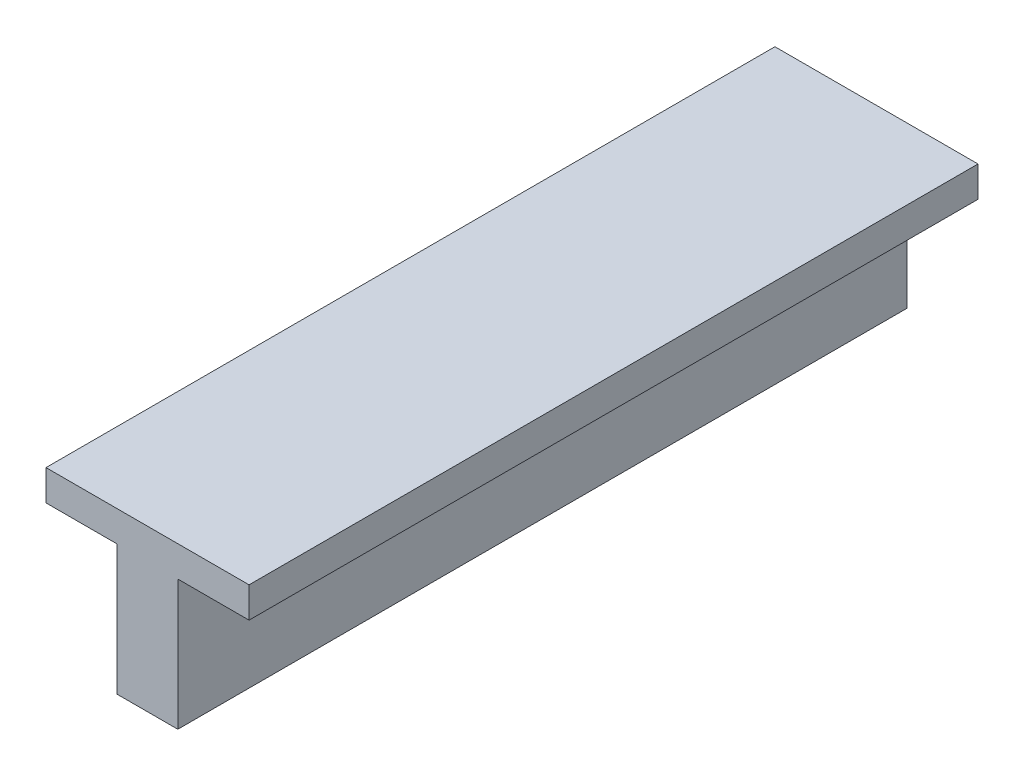
ISO-10303-21;
HEADER;
FILE_DESCRIPTION(('STEP AP214'),'2;1');
FILE_NAME('part.step','',(''),(''),'','','');
FILE_SCHEMA(('AUTOMOTIVE_DESIGN { 1 0 10303 214 1 1 1 1 }'));
ENDSEC;
DATA;
#1=APPLICATION_CONTEXT('core data for automotive mechanical design processes');
#2=APPLICATION_PROTOCOL_DEFINITION('international standard','automotive_design',2000,#1);
#3=PRODUCT_CONTEXT('',#1,'mechanical');
#4=PRODUCT('Part','Part','',(#3));
#5=PRODUCT_RELATED_PRODUCT_CATEGORY('part','',(#4));
#6=PRODUCT_DEFINITION_FORMATION('','',#4);
#7=PRODUCT_DEFINITION_CONTEXT('part definition',#1,'design');
#8=PRODUCT_DEFINITION('design','',#6,#7);
#9=PRODUCT_DEFINITION_SHAPE('','',#8);
#10=(LENGTH_UNIT() NAMED_UNIT(*) SI_UNIT(.MILLI.,.METRE.));
#11=(NAMED_UNIT(*) PLANE_ANGLE_UNIT() SI_UNIT($,.RADIAN.));
#12=(NAMED_UNIT(*) SI_UNIT($,.STERADIAN.) SOLID_ANGLE_UNIT());
#13=UNCERTAINTY_MEASURE_WITH_UNIT(LENGTH_MEASURE(1.E-05),#10,'distance_accuracy_value','');
#14=(GEOMETRIC_REPRESENTATION_CONTEXT(3) GLOBAL_UNCERTAINTY_ASSIGNED_CONTEXT((#13)) GLOBAL_UNIT_ASSIGNED_CONTEXT((#10,
#11,#12)) REPRESENTATION_CONTEXT('',''));
#15=CARTESIAN_POINT('',(0.,0.,0.));
#16=DIRECTION('',(0.,0.,1.));
#17=DIRECTION('',(1.,0.,0.));
#18=AXIS2_PLACEMENT_3D('',#15,#16,#17);
#19=CARTESIAN_POINT('',(-1.273023173553,-0.385219535327772,0.));
#20=DIRECTION('',(0.,-1.,0.));
#21=DIRECTION('',(1.,0.,0.));
#22=AXIS2_PLACEMENT_3D('',#19,#20,#21);
#23=PLANE('',#22);
#24=DIRECTION('',(-1.,0.,0.));
#25=VECTOR('',#24,1.);
#26=CARTESIAN_POINT('',(-1.2632489838099,-0.385219535327772,0.));
#27=LINE('',#26,#25);
#28=CARTESIAN_POINT('',(-1.2632489838099,-0.385219535327772,0.));
#29=VERTEX_POINT('',#28);
#30=CARTESIAN_POINT('',(-1.273023173553,-0.385219535327772,0.));
#31=VERTEX_POINT('',#30);
#32=EDGE_CURVE('E11',#29,#31,#27,.T.);
#33=ORIENTED_EDGE('',*,*,#32,.F.);
#34=DIRECTION('',(0.,0.,1.));
#35=VECTOR('',#34,1.);
#36=CARTESIAN_POINT('',(-1.2632489838099,-0.385219535327772,0.));
#37=LINE('',#36,#35);
#38=CARTESIAN_POINT('',(-1.2632489838099,-0.385219535327772,0.1));
#39=VERTEX_POINT('',#38);
#40=EDGE_CURVE('E24',#29,#39,#37,.T.);
#41=ORIENTED_EDGE('',*,*,#40,.T.);
#42=DIRECTION('',(1.,0.,0.));
#43=VECTOR('',#42,1.);
#44=CARTESIAN_POINT('',(-1.2632489838099,-0.385219535327772,0.1));
#45=LINE('',#44,#43);
#46=CARTESIAN_POINT('',(-1.273023173553,-0.385219535327772,0.1));
#47=VERTEX_POINT('',#46);
#48=EDGE_CURVE('E100',#47,#39,#45,.T.);
#49=ORIENTED_EDGE('',*,*,#48,.F.);
#50=DIRECTION('',(0.,0.,1.));
#51=VECTOR('',#50,1.);
#52=CARTESIAN_POINT('',(-1.273023173553,-0.385219535327772,0.));
#53=LINE('',#52,#51);
#54=EDGE_CURVE('E141',#31,#47,#53,.T.);
#55=ORIENTED_EDGE('',*,*,#54,.F.);
#56=EDGE_LOOP('',(#33,#41,#49,#55));
#57=FACE_BOUND('',#56,.T.);
#58=ADVANCED_FACE('F17',(#57),#23,.T.);
#59=CARTESIAN_POINT('',(-1.273023173553,-0.381020386169379,0.));
#60=DIRECTION('',(-1.,0.,0.));
#61=DIRECTION('',(0.,-1.,0.));
#62=AXIS2_PLACEMENT_3D('',#59,#60,#61);
#63=PLANE('',#62);
#64=DIRECTION('',(0.,1.,0.));
#65=VECTOR('',#64,1.);
#66=CARTESIAN_POINT('',(-1.273023173553,-0.385219535327772,0.));
#67=LINE('',#66,#65);
#68=CARTESIAN_POINT('',(-1.273023173553,-0.381020386169379,0.));
#69=VERTEX_POINT('',#68);
#70=EDGE_CURVE('E139',#31,#69,#67,.T.);
#71=ORIENTED_EDGE('',*,*,#70,.F.);
#72=ORIENTED_EDGE('',*,*,#54,.T.);
#73=DIRECTION('',(0.,-1.,0.));
#74=VECTOR('',#73,1.);
#75=CARTESIAN_POINT('',(-1.273023173553,-0.385219535327772,0.1));
#76=LINE('',#75,#74);
#77=CARTESIAN_POINT('',(-1.273023173553,-0.381020386169379,0.1));
#78=VERTEX_POINT('',#77);
#79=EDGE_CURVE('E137',#78,#47,#76,.T.);
#80=ORIENTED_EDGE('',*,*,#79,.F.);
#81=DIRECTION('',(0.,0.,1.));
#82=VECTOR('',#81,1.);
#83=CARTESIAN_POINT('',(-1.273023173553,-0.381020386169379,0.));
#84=LINE('',#83,#82);
#85=EDGE_CURVE('E134',#69,#78,#84,.T.);
#86=ORIENTED_EDGE('',*,*,#85,.F.);
#87=EDGE_LOOP('',(#71,#72,#80,#86));
#88=FACE_BOUND('',#87,.T.);
#89=ADVANCED_FACE('F163',(#88),#63,.T.);
#90=CARTESIAN_POINT('',(-1.245165839349,-0.381020386169379,0.));
#91=DIRECTION('',(0.,1.,0.));
#92=DIRECTION('',(-1.,0.,0.));
#93=AXIS2_PLACEMENT_3D('',#90,#91,#92);
#94=PLANE('',#93);
#95=DIRECTION('',(1.,0.,0.));
#96=VECTOR('',#95,1.);
#97=CARTESIAN_POINT('',(-1.273023173553,-0.381020386169379,0.));
#98=LINE('',#97,#96);
#99=CARTESIAN_POINT('',(-1.245165839349,-0.381020386169379,0.));
#100=VERTEX_POINT('',#99);
#101=EDGE_CURVE('E132',#69,#100,#98,.T.);
#102=ORIENTED_EDGE('',*,*,#101,.F.);
#103=ORIENTED_EDGE('',*,*,#85,.T.);
#104=DIRECTION('',(-1.,0.,0.));
#105=VECTOR('',#104,1.);
#106=CARTESIAN_POINT('',(-1.273023173553,-0.381020386169379,0.1));
#107=LINE('',#106,#105);
#108=CARTESIAN_POINT('',(-1.245165839349,-0.381020386169379,0.1));
#109=VERTEX_POINT('',#108);
#110=EDGE_CURVE('E129',#109,#78,#107,.T.);
#111=ORIENTED_EDGE('',*,*,#110,.F.);
#112=DIRECTION('',(0.,0.,1.));
#113=VECTOR('',#112,1.);
#114=CARTESIAN_POINT('',(-1.245165839349,-0.381020386169379,0.));
#115=LINE('',#114,#113);
#116=EDGE_CURVE('E126',#100,#109,#115,.T.);
#117=ORIENTED_EDGE('',*,*,#116,.F.);
#118=EDGE_LOOP('',(#102,#103,#111,#117));
#119=FACE_BOUND('',#118,.T.);
#120=ADVANCED_FACE('F159',(#119),#94,.T.);
#121=CARTESIAN_POINT('',(-1.245165839349,-0.385219535327772,0.));
#122=DIRECTION('',(1.,0.,0.));
#123=DIRECTION('',(0.,1.,0.));
#124=AXIS2_PLACEMENT_3D('',#121,#122,#123);
#125=PLANE('',#124);
#126=DIRECTION('',(0.,-1.,0.));
#127=VECTOR('',#126,1.);
#128=CARTESIAN_POINT('',(-1.245165839349,-0.381020386169379,0.));
#129=LINE('',#128,#127);
#130=CARTESIAN_POINT('',(-1.245165839349,-0.385219535327772,0.));
#131=VERTEX_POINT('',#130);
#132=EDGE_CURVE('E124',#100,#131,#129,.T.);
#133=ORIENTED_EDGE('',*,*,#132,.F.);
#134=ORIENTED_EDGE('',*,*,#116,.T.);
#135=DIRECTION('',(0.,1.,0.));
#136=VECTOR('',#135,1.);
#137=CARTESIAN_POINT('',(-1.245165839349,-0.381020386169379,0.1));
#138=LINE('',#137,#136);
#139=CARTESIAN_POINT('',(-1.245165839349,-0.385219535327772,0.1));
#140=VERTEX_POINT('',#139);
#141=EDGE_CURVE('E121',#140,#109,#138,.T.);
#142=ORIENTED_EDGE('',*,*,#141,.F.);
#143=DIRECTION('',(0.,0.,1.));
#144=VECTOR('',#143,1.);
#145=CARTESIAN_POINT('',(-1.245165839349,-0.385219535327772,0.));
#146=LINE('',#145,#144);
#147=EDGE_CURVE('E118',#131,#140,#146,.T.);
#148=ORIENTED_EDGE('',*,*,#147,.F.);
#149=EDGE_LOOP('',(#133,#134,#142,#148));
#150=FACE_BOUND('',#149,.T.);
#151=ADVANCED_FACE('F155',(#150),#125,.T.);
#152=CARTESIAN_POINT('',(-1.2549400290922,-0.385219535327772,0.));
#153=DIRECTION('',(0.,-1.,0.));
#154=DIRECTION('',(1.,0.,0.));
#155=AXIS2_PLACEMENT_3D('',#152,#153,#154);
#156=PLANE('',#155);
#157=DIRECTION('',(-1.,0.,0.));
#158=VECTOR('',#157,1.);
#159=CARTESIAN_POINT('',(-1.245165839349,-0.385219535327772,0.));
#160=LINE('',#159,#158);
#161=CARTESIAN_POINT('',(-1.2549400290922,-0.385219535327772,0.));
#162=VERTEX_POINT('',#161);
#163=EDGE_CURVE('E116',#131,#162,#160,.T.);
#164=ORIENTED_EDGE('',*,*,#163,.F.);
#165=ORIENTED_EDGE('',*,*,#147,.T.);
#166=DIRECTION('',(1.,0.,0.));
#167=VECTOR('',#166,1.);
#168=CARTESIAN_POINT('',(-1.245165839349,-0.385219535327772,0.1));
#169=LINE('',#168,#167);
#170=CARTESIAN_POINT('',(-1.2549400290922,-0.385219535327772,0.1));
#171=VERTEX_POINT('',#170);
#172=EDGE_CURVE('E113',#171,#140,#169,.T.);
#173=ORIENTED_EDGE('',*,*,#172,.F.);
#174=DIRECTION('',(0.,0.,1.));
#175=VECTOR('',#174,1.);
#176=CARTESIAN_POINT('',(-1.2549400290922,-0.385219535327772,0.));
#177=LINE('',#176,#175);
#178=EDGE_CURVE('E110',#162,#171,#177,.T.);
#179=ORIENTED_EDGE('',*,*,#178,.F.);
#180=EDGE_LOOP('',(#164,#165,#173,#179));
#181=FACE_BOUND('',#180,.T.);
#182=ADVANCED_FACE('F151',(#181),#156,.T.);
#183=CARTESIAN_POINT('',(-1.2549400290922,-0.403070386430895,0.));
#184=DIRECTION('',(1.,0.,0.));
#185=DIRECTION('',(0.,1.,0.));
#186=AXIS2_PLACEMENT_3D('',#183,#184,#185);
#187=PLANE('',#186);
#188=DIRECTION('',(0.,-1.,0.));
#189=VECTOR('',#188,1.);
#190=CARTESIAN_POINT('',(-1.2549400290922,-0.385219535327772,0.));
#191=LINE('',#190,#189);
#192=CARTESIAN_POINT('',(-1.2549400290922,-0.403070386430895,0.));
#193=VERTEX_POINT('',#192);
#194=EDGE_CURVE('E108',#162,#193,#191,.T.);
#195=ORIENTED_EDGE('',*,*,#194,.F.);
#196=ORIENTED_EDGE('',*,*,#178,.T.);
#197=DIRECTION('',(0.,1.,0.));
#198=VECTOR('',#197,1.);
#199=CARTESIAN_POINT('',(-1.2549400290922,-0.385219535327772,0.1));
#200=LINE('',#199,#198);
#201=CARTESIAN_POINT('',(-1.2549400290922,-0.403070386430895,0.1));
#202=VERTEX_POINT('',#201);
#203=EDGE_CURVE('E106',#202,#171,#200,.T.);
#204=ORIENTED_EDGE('',*,*,#203,.F.);
#205=DIRECTION('',(0.,0.,1.));
#206=VECTOR('',#205,1.);
#207=CARTESIAN_POINT('',(-1.2549400290922,-0.403070386430895,0.));
#208=LINE('',#207,#206);
#209=EDGE_CURVE('E85',#193,#202,#208,.T.);
#210=ORIENTED_EDGE('',*,*,#209,.F.);
#211=EDGE_LOOP('',(#195,#196,#204,#210));
#212=FACE_BOUND('',#211,.T.);
#213=ADVANCED_FACE('F149',(#212),#187,.T.);
#214=CARTESIAN_POINT('',(-1.2632489838099,-0.403070386430895,0.));
#215=DIRECTION('',(0.,-1.,0.));
#216=DIRECTION('',(1.,0.,0.));
#217=AXIS2_PLACEMENT_3D('',#214,#215,#216);
#218=PLANE('',#217);
#219=DIRECTION('',(-1.,0.,0.));
#220=VECTOR('',#219,1.);
#221=CARTESIAN_POINT('',(-1.2549400290922,-0.403070386430895,0.));
#222=LINE('',#221,#220);
#223=CARTESIAN_POINT('',(-1.2632489838099,-0.403070386430895,0.));
#224=VERTEX_POINT('',#223);
#225=EDGE_CURVE('E89',#193,#224,#222,.T.);
#226=ORIENTED_EDGE('',*,*,#225,.F.);
#227=ORIENTED_EDGE('',*,*,#209,.T.);
#228=DIRECTION('',(1.,0.,0.));
#229=VECTOR('',#228,1.);
#230=CARTESIAN_POINT('',(-1.2549400290922,-0.403070386430895,0.1));
#231=LINE('',#230,#229);
#232=CARTESIAN_POINT('',(-1.2632489838099,-0.403070386430895,0.1));
#233=VERTEX_POINT('',#232);
#234=EDGE_CURVE('E78',#233,#202,#231,.T.);
#235=ORIENTED_EDGE('',*,*,#234,.F.);
#236=DIRECTION('',(0.,0.,1.));
#237=VECTOR('',#236,1.);
#238=CARTESIAN_POINT('',(-1.2632489838099,-0.403070386430895,0.));
#239=LINE('',#238,#237);
#240=EDGE_CURVE('E82',#224,#233,#239,.T.);
#241=ORIENTED_EDGE('',*,*,#240,.F.);
#242=EDGE_LOOP('',(#226,#227,#235,#241));
#243=FACE_BOUND('',#242,.T.);
#244=ADVANCED_FACE('F81',(#243),#218,.T.);
#245=CARTESIAN_POINT('',(-1.2632489838099,-0.385219535327772,0.));
#246=DIRECTION('',(-1.,0.,0.));
#247=DIRECTION('',(0.,-1.,0.));
#248=AXIS2_PLACEMENT_3D('',#245,#246,#247);
#249=PLANE('',#248);
#250=DIRECTION('',(0.,1.,0.));
#251=VECTOR('',#250,1.);
#252=CARTESIAN_POINT('',(-1.2632489838099,-0.403070386430895,0.));
#253=LINE('',#252,#251);
#254=EDGE_CURVE('E95',#224,#29,#253,.T.);
#255=ORIENTED_EDGE('',*,*,#254,.F.);
#256=ORIENTED_EDGE('',*,*,#240,.T.);
#257=DIRECTION('',(0.,-1.,0.));
#258=VECTOR('',#257,1.);
#259=CARTESIAN_POINT('',(-1.2632489838099,-0.403070386430895,0.1));
#260=LINE('',#259,#258);
#261=EDGE_CURVE('E94',#39,#233,#260,.T.);
#262=ORIENTED_EDGE('',*,*,#261,.F.);
#263=ORIENTED_EDGE('',*,*,#40,.F.);
#264=EDGE_LOOP('',(#255,#256,#262,#263));
#265=FACE_BOUND('',#264,.T.);
#266=ADVANCED_FACE('F93',(#265),#249,.T.);
#267=CARTESIAN_POINT('',(-1.259094506451,-0.388549354952694,0.));
#268=DIRECTION('',(0.,0.,1.));
#269=DIRECTION('',(1.,0.,0.));
#270=AXIS2_PLACEMENT_3D('',#267,#268,#269);
#271=PLANE('',#270);
#272=ORIENTED_EDGE('',*,*,#254,.T.);
#273=ORIENTED_EDGE('',*,*,#32,.T.);
#274=ORIENTED_EDGE('',*,*,#70,.T.);
#275=ORIENTED_EDGE('',*,*,#101,.T.);
#276=ORIENTED_EDGE('',*,*,#132,.T.);
#277=ORIENTED_EDGE('',*,*,#163,.T.);
#278=ORIENTED_EDGE('',*,*,#194,.T.);
#279=ORIENTED_EDGE('',*,*,#225,.T.);
#280=EDGE_LOOP('',(#272,#273,#274,#275,#276,#277,#278,#279));
#281=FACE_BOUND('',#280,.T.);
#282=ADVANCED_FACE('F144',(#281),#271,.F.);
#283=CARTESIAN_POINT('',(-1.259094506451,-0.388549354952694,0.1));
#284=DIRECTION('',(0.,0.,1.));
#285=DIRECTION('',(1.,0.,0.));
#286=AXIS2_PLACEMENT_3D('',#283,#284,#285);
#287=PLANE('',#286);
#288=ORIENTED_EDGE('',*,*,#261,.T.);
#289=ORIENTED_EDGE('',*,*,#234,.T.);
#290=ORIENTED_EDGE('',*,*,#203,.T.);
#291=ORIENTED_EDGE('',*,*,#172,.T.);
#292=ORIENTED_EDGE('',*,*,#141,.T.);
#293=ORIENTED_EDGE('',*,*,#110,.T.);
#294=ORIENTED_EDGE('',*,*,#79,.T.);
#295=ORIENTED_EDGE('',*,*,#48,.T.);
#296=EDGE_LOOP('',(#288,#289,#290,#291,#292,#293,#294,#295));
#297=FACE_BOUND('',#296,.T.);
#298=ADVANCED_FACE('F98',(#297),#287,.T.);
#299=CLOSED_SHELL('',(#58,#89,#120,#151,#182,#213,#244,#266,#282,#298));
#300=MANIFOLD_SOLID_BREP('B1',#299);
#301=ADVANCED_BREP_SHAPE_REPRESENTATION('',(#18,#300),#14);
#302=SHAPE_DEFINITION_REPRESENTATION(#9,#301);
ENDSEC;
END-ISO-10303-21;
